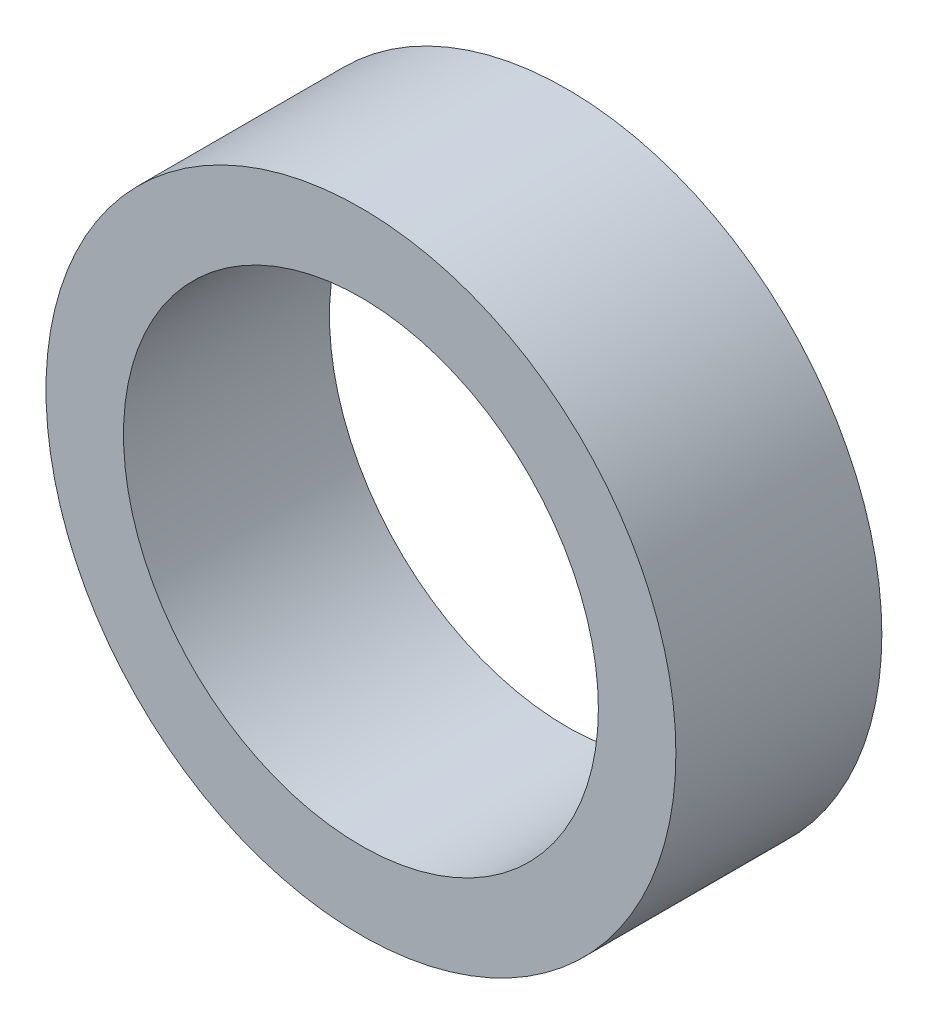
ISO-10303-21;
HEADER;
FILE_DESCRIPTION(('STEP AP214'),'2;1');
FILE_NAME('part.step','',(''),(''),'','','');
FILE_SCHEMA(('AUTOMOTIVE_DESIGN { 1 0 10303 214 1 1 1 1 }'));
ENDSEC;
DATA;
#1=APPLICATION_CONTEXT('core data for automotive mechanical design processes');
#2=APPLICATION_PROTOCOL_DEFINITION('international standard','automotive_design',2000,#1);
#3=PRODUCT_CONTEXT('',#1,'mechanical');
#4=PRODUCT('Part','Part','',(#3));
#5=PRODUCT_RELATED_PRODUCT_CATEGORY('part','',(#4));
#6=PRODUCT_DEFINITION_FORMATION('','',#4);
#7=PRODUCT_DEFINITION_CONTEXT('part definition',#1,'design');
#8=PRODUCT_DEFINITION('design','',#6,#7);
#9=PRODUCT_DEFINITION_SHAPE('','',#8);
#10=(LENGTH_UNIT() NAMED_UNIT(*) SI_UNIT(.MILLI.,.METRE.));
#11=(NAMED_UNIT(*) PLANE_ANGLE_UNIT() SI_UNIT($,.RADIAN.));
#12=(NAMED_UNIT(*) SI_UNIT($,.STERADIAN.) SOLID_ANGLE_UNIT());
#13=UNCERTAINTY_MEASURE_WITH_UNIT(LENGTH_MEASURE(1.E-05),#10,'distance_accuracy_value','');
#14=(GEOMETRIC_REPRESENTATION_CONTEXT(3) GLOBAL_UNCERTAINTY_ASSIGNED_CONTEXT((#13)) GLOBAL_UNIT_ASSIGNED_CONTEXT((#10,
#11,#12)) REPRESENTATION_CONTEXT('',''));
#15=CARTESIAN_POINT('',(0.,0.,0.));
#16=DIRECTION('',(0.,0.,1.));
#17=DIRECTION('',(1.,0.,0.));
#18=AXIS2_PLACEMENT_3D('',#15,#16,#17);
#19=CARTESIAN_POINT('',(0.,6.5,-18.75));
#20=DIRECTION('',(0.,0.,1.));
#21=DIRECTION('',(1.,0.,0.));
#22=AXIS2_PLACEMENT_3D('',#19,#20,#21);
#23=PLANE('',#22);
#24=CARTESIAN_POINT('',(0.,0.,-18.75));
#25=DIRECTION('',(0.,0.,1.));
#26=DIRECTION('',(1.,0.,0.));
#27=AXIS2_PLACEMENT_3D('',#24,#25,#26);
#28=CIRCLE('',#27,6.5);
#29=CARTESIAN_POINT('',(6.5,0.,-18.75));
#30=VERTEX_POINT('',#29);
#31=EDGE_CURVE('E56',#30,#30,#28,.T.);
#32=ORIENTED_EDGE('',*,*,#31,.F.);
#33=EDGE_LOOP('',(#32));
#34=FACE_BOUND('',#33,.T.);
#35=CARTESIAN_POINT('',(0.,0.,-18.75));
#36=DIRECTION('',(0.,0.,1.));
#37=DIRECTION('',(1.,0.,0.));
#38=AXIS2_PLACEMENT_3D('',#35,#36,#37);
#39=CIRCLE('',#38,4.9);
#40=CARTESIAN_POINT('',(4.9,0.,-18.75));
#41=VERTEX_POINT('',#40);
#42=EDGE_CURVE('E12',#41,#41,#39,.T.);
#43=ORIENTED_EDGE('',*,*,#42,.T.);
#44=EDGE_LOOP('',(#43));
#45=FACE_BOUND('',#44,.T.);
#46=ADVANCED_FACE('F42',(#34,#45),#23,.F.);
#47=CARTESIAN_POINT('',(0.,0.,1000.));
#48=DIRECTION('',(0.,0.,1.));
#49=DIRECTION('',(1.,0.,0.));
#50=AXIS2_PLACEMENT_3D('',#47,#48,#49);
#51=CYLINDRICAL_SURFACE('',#50,4.9);
#52=ORIENTED_EDGE('',*,*,#42,.F.);
#53=EDGE_LOOP('',(#52));
#54=FACE_BOUND('',#53,.T.);
#55=CARTESIAN_POINT('',(0.,0.,-14.5));
#56=DIRECTION('',(0.,0.,1.));
#57=DIRECTION('',(1.,0.,0.));
#58=AXIS2_PLACEMENT_3D('',#55,#56,#57);
#59=CIRCLE('',#58,4.9);
#60=CARTESIAN_POINT('',(4.9,0.,-14.5));
#61=VERTEX_POINT('',#60);
#62=EDGE_CURVE('E48',#61,#61,#59,.T.);
#63=ORIENTED_EDGE('',*,*,#62,.T.);
#64=EDGE_LOOP('',(#63));
#65=FACE_BOUND('',#64,.T.);
#66=ADVANCED_FACE('F65',(#54,#65),#51,.F.);
#67=CARTESIAN_POINT('',(0.,6.5,-14.5));
#68=DIRECTION('',(0.,0.,-1.));
#69=DIRECTION('',(-1.,0.,0.));
#70=AXIS2_PLACEMENT_3D('',#67,#68,#69);
#71=PLANE('',#70);
#72=ORIENTED_EDGE('',*,*,#62,.F.);
#73=EDGE_LOOP('',(#72));
#74=FACE_BOUND('',#73,.T.);
#75=CARTESIAN_POINT('',(0.,0.,-14.5));
#76=DIRECTION('',(0.,0.,1.));
#77=DIRECTION('',(1.,0.,0.));
#78=AXIS2_PLACEMENT_3D('',#75,#76,#77);
#79=CIRCLE('',#78,6.5);
#80=CARTESIAN_POINT('',(6.5,0.,-14.5));
#81=VERTEX_POINT('',#80);
#82=EDGE_CURVE('E52',#81,#81,#79,.T.);
#83=ORIENTED_EDGE('',*,*,#82,.T.);
#84=EDGE_LOOP('',(#83));
#85=FACE_BOUND('',#84,.T.);
#86=ADVANCED_FACE('F69',(#74,#85),#71,.F.);
#87=CARTESIAN_POINT('',(0.,0.,1000.));
#88=DIRECTION('',(0.,0.,1.));
#89=DIRECTION('',(1.,0.,0.));
#90=AXIS2_PLACEMENT_3D('',#87,#88,#89);
#91=CYLINDRICAL_SURFACE('',#90,6.5);
#92=ORIENTED_EDGE('',*,*,#82,.F.);
#93=EDGE_LOOP('',(#92));
#94=FACE_BOUND('',#93,.T.);
#95=ORIENTED_EDGE('',*,*,#31,.T.);
#96=EDGE_LOOP('',(#95));
#97=FACE_BOUND('',#96,.T.);
#98=ADVANCED_FACE('F62',(#94,#97),#91,.T.);
#99=CLOSED_SHELL('',(#46,#66,#86,#98));
#100=MANIFOLD_SOLID_BREP('B2',#99);
#101=ADVANCED_BREP_SHAPE_REPRESENTATION('',(#18,#100),#14);
#102=SHAPE_DEFINITION_REPRESENTATION(#9,#101);
ENDSEC;
END-ISO-10303-21;
